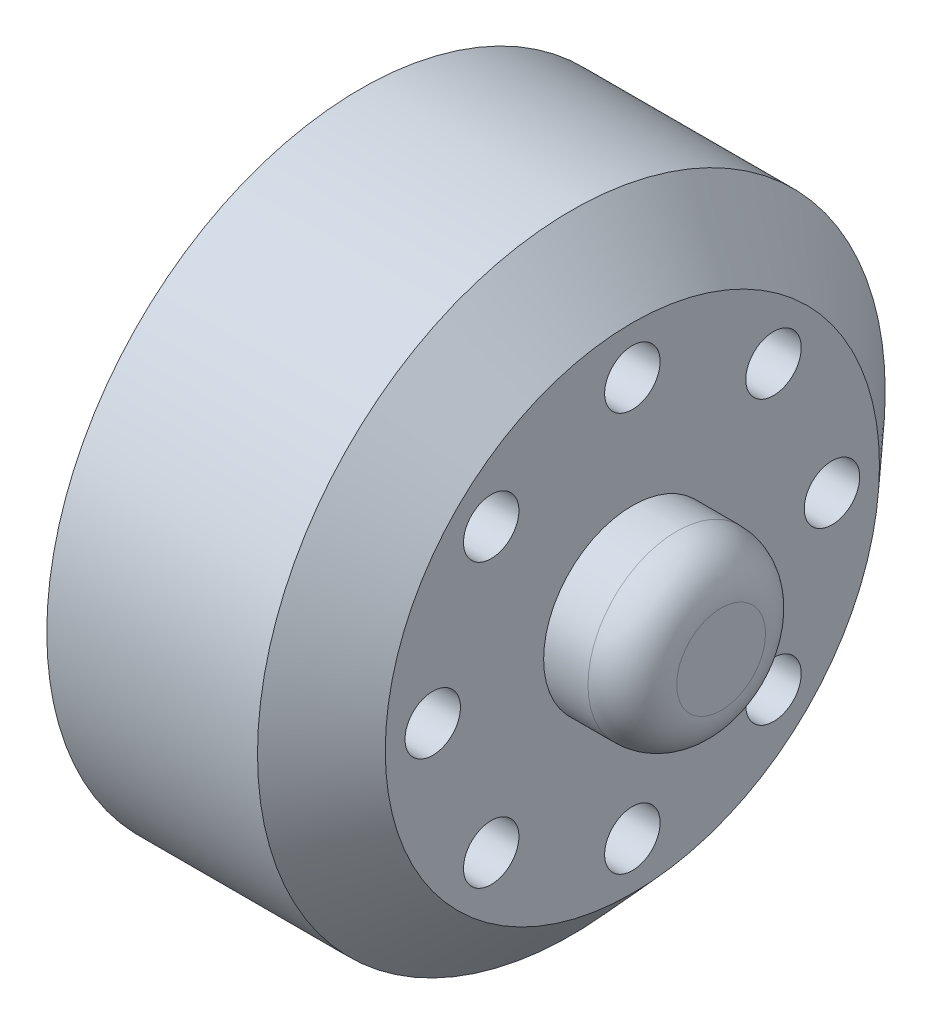
ISO-10303-21;
HEADER;
FILE_DESCRIPTION(('STEP AP214'),'2;1');
FILE_NAME('part.step','',(''),(''),'','','');
FILE_SCHEMA(('AUTOMOTIVE_DESIGN { 1 0 10303 214 1 1 1 1 }'));
ENDSEC;
DATA;
#1=APPLICATION_CONTEXT('core data for automotive mechanical design processes');
#2=APPLICATION_PROTOCOL_DEFINITION('international standard','automotive_design',2000,#1);
#3=PRODUCT_CONTEXT('',#1,'mechanical');
#4=PRODUCT('Part','Part','',(#3));
#5=PRODUCT_RELATED_PRODUCT_CATEGORY('part','',(#4));
#6=PRODUCT_DEFINITION_FORMATION('','',#4);
#7=PRODUCT_DEFINITION_CONTEXT('part definition',#1,'design');
#8=PRODUCT_DEFINITION('design','',#6,#7);
#9=PRODUCT_DEFINITION_SHAPE('','',#8);
#10=(LENGTH_UNIT() NAMED_UNIT(*) SI_UNIT(.MILLI.,.METRE.));
#11=(NAMED_UNIT(*) PLANE_ANGLE_UNIT() SI_UNIT($,.RADIAN.));
#12=(NAMED_UNIT(*) SI_UNIT($,.STERADIAN.) SOLID_ANGLE_UNIT());
#13=UNCERTAINTY_MEASURE_WITH_UNIT(LENGTH_MEASURE(1.E-05),#10,'distance_accuracy_value','');
#14=(GEOMETRIC_REPRESENTATION_CONTEXT(3) GLOBAL_UNCERTAINTY_ASSIGNED_CONTEXT((#13)) GLOBAL_UNIT_ASSIGNED_CONTEXT((#10,
#11,#12)) REPRESENTATION_CONTEXT('',''));
#15=CARTESIAN_POINT('',(0.,0.,0.));
#16=DIRECTION('',(0.,0.,1.));
#17=DIRECTION('',(1.,0.,0.));
#18=AXIS2_PLACEMENT_3D('',#15,#16,#17);
#19=CARTESIAN_POINT('',(-12.3913043478261,0.,0.));
#20=DIRECTION('',(-1.,0.,0.));
#21=DIRECTION('',(0.,0.,1.));
#22=AXIS2_PLACEMENT_3D('',#19,#20,#21);
#23=CYLINDRICAL_SURFACE('',#22,10.5);
#24=CARTESIAN_POINT('',(5.36956521739131,0.,0.));
#25=DIRECTION('',(-1.,0.,0.));
#26=DIRECTION('',(0.,0.,1.));
#27=AXIS2_PLACEMENT_3D('',#24,#25,#26);
#28=CIRCLE('',#27,10.5);
#29=CARTESIAN_POINT('',(5.36956521739131,5.74806476984158,-8.7869079545484));
#30=VERTEX_POINT('',#29);
#31=CARTESIAN_POINT('',(5.36956521739131,2.14878662286819,-10.2777777777778));
#32=VERTEX_POINT('',#31);
#33=EDGE_CURVE('E278',#30,#32,#28,.T.);
#34=ORIENTED_EDGE('',*,*,#33,.F.);
#35=DIRECTION('',(-1.,0.,0.));
#36=VECTOR('',#35,1.);
#37=CARTESIAN_POINT('',(1.99456521739131,5.74806476984158,-8.78690795454841));
#38=LINE('',#37,#36);
#39=CARTESIAN_POINT('',(-1.63043478260869,5.74806476984159,-8.78690795454841));
#40=VERTEX_POINT('',#39);
#41=EDGE_CURVE('E12',#30,#40,#38,.T.);
#42=ORIENTED_EDGE('',*,*,#41,.T.);
#43=CARTESIAN_POINT('',(-1.63043478260869,0.,0.));
#44=DIRECTION('',(-1.,0.,0.));
#45=DIRECTION('',(0.,0.,1.));
#46=AXIS2_PLACEMENT_3D('',#43,#44,#45);
#47=CIRCLE('',#46,10.5);
#48=CARTESIAN_POINT('',(-1.63043478260869,2.14878662286819,-10.2777777777778));
#49=VERTEX_POINT('',#48);
#50=EDGE_CURVE('E183',#40,#49,#47,.T.);
#51=ORIENTED_EDGE('',*,*,#50,.T.);
#52=DIRECTION('',(-1.,0.,0.));
#53=VECTOR('',#52,1.);
#54=CARTESIAN_POINT('',(1.99456521739131,2.14878662286819,-10.2777777777778));
#55=LINE('',#54,#53);
#56=EDGE_CURVE('E260',#49,#32,#55,.F.);
#57=ORIENTED_EDGE('',*,*,#56,.T.);
#58=EDGE_LOOP('',(#34,#42,#51,#57));
#59=FACE_BOUND('',#58,.T.);
#60=ADVANCED_FACE('F35',(#59),#23,.F.);
#61=CARTESIAN_POINT('',(5.36956521739131,-2.14878662286994,-10.2777777777774));
#62=VERTEX_POINT('',#61);
#63=CARTESIAN_POINT('',(5.36956521739131,-5.74806476984194,-8.78690795454817));
#64=VERTEX_POINT('',#63);
#65=EDGE_CURVE('E279',#62,#64,#28,.T.);
#66=ORIENTED_EDGE('',*,*,#65,.F.);
#67=DIRECTION('',(-1.,0.,0.));
#68=VECTOR('',#67,1.);
#69=CARTESIAN_POINT('',(1.99456521739131,-2.14878662286994,-10.2777777777774));
#70=LINE('',#69,#68);
#71=CARTESIAN_POINT('',(-1.63043478260869,-2.14878662286994,-10.2777777777774));
#72=VERTEX_POINT('',#71);
#73=EDGE_CURVE('E263',#62,#72,#70,.T.);
#74=ORIENTED_EDGE('',*,*,#73,.T.);
#75=CARTESIAN_POINT('',(-1.63043478260869,-5.74806476984194,-8.78690795454817));
#76=VERTEX_POINT('',#75);
#77=EDGE_CURVE('E766',#72,#76,#47,.T.);
#78=ORIENTED_EDGE('',*,*,#77,.T.);
#79=DIRECTION('',(-1.,0.,0.));
#80=VECTOR('',#79,1.);
#81=CARTESIAN_POINT('',(1.99456521739131,-5.74806476984194,-8.78690795454817));
#82=LINE('',#81,#80);
#83=EDGE_CURVE('E254',#76,#64,#82,.F.);
#84=ORIENTED_EDGE('',*,*,#83,.T.);
#85=EDGE_LOOP('',(#66,#74,#78,#84));
#86=FACE_BOUND('',#85,.T.);
#87=ADVANCED_FACE('F399',(#86),#23,.F.);
#88=CARTESIAN_POINT('',(5.36956521739131,-8.78690795454984,-5.74806476983939));
#89=VERTEX_POINT('',#88);
#90=CARTESIAN_POINT('',(5.36956521739131,-10.2777777777777,-2.14878662286847));
#91=VERTEX_POINT('',#90);
#92=EDGE_CURVE('E282',#89,#91,#28,.T.);
#93=ORIENTED_EDGE('',*,*,#92,.F.);
#94=DIRECTION('',(-1.,0.,0.));
#95=VECTOR('',#94,1.);
#96=CARTESIAN_POINT('',(1.99456521739131,-8.78690795454984,-5.74806476983939));
#97=LINE('',#96,#95);
#98=CARTESIAN_POINT('',(-1.63043478260869,-8.78690795454984,-5.74806476983939));
#99=VERTEX_POINT('',#98);
#100=EDGE_CURVE('E257',#89,#99,#97,.T.);
#101=ORIENTED_EDGE('',*,*,#100,.T.);
#102=CARTESIAN_POINT('',(-1.63043478260869,-10.2777777777777,-2.14878662286847));
#103=VERTEX_POINT('',#102);
#104=EDGE_CURVE('E765',#99,#103,#47,.T.);
#105=ORIENTED_EDGE('',*,*,#104,.T.);
#106=DIRECTION('',(-1.,0.,0.));
#107=VECTOR('',#106,1.);
#108=CARTESIAN_POINT('',(1.99456521739131,-10.2777777777777,-2.14878662286847));
#109=LINE('',#108,#107);
#110=EDGE_CURVE('E248',#103,#91,#109,.F.);
#111=ORIENTED_EDGE('',*,*,#110,.T.);
#112=EDGE_LOOP('',(#93,#101,#105,#111));
#113=FACE_BOUND('',#112,.T.);
#114=ADVANCED_FACE('F405',(#113),#23,.F.);
#115=CARTESIAN_POINT('',(5.36956521739131,-10.277777777777,2.14878662287197));
#116=VERTEX_POINT('',#115);
#117=CARTESIAN_POINT('',(5.36956521739131,-8.78690795454833,5.7480647698417));
#118=VERTEX_POINT('',#117);
#119=EDGE_CURVE('E286',#116,#118,#28,.T.);
#120=ORIENTED_EDGE('',*,*,#119,.F.);
#121=DIRECTION('',(-1.,0.,0.));
#122=VECTOR('',#121,1.);
#123=CARTESIAN_POINT('',(1.99456521739131,-10.277777777777,2.14878662287196));
#124=LINE('',#123,#122);
#125=CARTESIAN_POINT('',(-1.63043478260869,-10.277777777777,2.14878662287196));
#126=VERTEX_POINT('',#125);
#127=EDGE_CURVE('E251',#116,#126,#124,.T.);
#128=ORIENTED_EDGE('',*,*,#127,.T.);
#129=CARTESIAN_POINT('',(-1.63043478260869,-8.78690795454833,5.7480647698417));
#130=VERTEX_POINT('',#129);
#131=EDGE_CURVE('E761',#126,#130,#47,.T.);
#132=ORIENTED_EDGE('',*,*,#131,.T.);
#133=DIRECTION('',(-1.,0.,0.));
#134=VECTOR('',#133,1.);
#135=CARTESIAN_POINT('',(1.99456521739131,-8.78690795454833,5.74806476984171));
#136=LINE('',#135,#134);
#137=EDGE_CURVE('E243',#130,#118,#136,.F.);
#138=ORIENTED_EDGE('',*,*,#137,.T.);
#139=EDGE_LOOP('',(#120,#128,#132,#138));
#140=FACE_BOUND('',#139,.T.);
#141=ADVANCED_FACE('F426',(#140),#23,.F.);
#142=CARTESIAN_POINT('',(5.36956521739131,-5.74806476983915,8.78690795454999));
#143=VERTEX_POINT('',#142);
#144=CARTESIAN_POINT('',(5.36956521739131,-2.14878662286855,10.2777777777777));
#145=VERTEX_POINT('',#144);
#146=EDGE_CURVE('E181',#143,#145,#28,.T.);
#147=ORIENTED_EDGE('',*,*,#146,.F.);
#148=DIRECTION('',(-1.,0.,0.));
#149=VECTOR('',#148,1.);
#150=CARTESIAN_POINT('',(1.99456521739131,-5.74806476983915,8.78690795454999));
#151=LINE('',#150,#149);
#152=CARTESIAN_POINT('',(-1.63043478260869,-5.74806476983915,8.78690795454999));
#153=VERTEX_POINT('',#152);
#154=EDGE_CURVE('E245',#143,#153,#151,.T.);
#155=ORIENTED_EDGE('',*,*,#154,.T.);
#156=CARTESIAN_POINT('',(-1.63043478260869,-2.14878662286855,10.2777777777777));
#157=VERTEX_POINT('',#156);
#158=EDGE_CURVE('E182',#153,#157,#47,.T.);
#159=ORIENTED_EDGE('',*,*,#158,.T.);
#160=DIRECTION('',(-1.,0.,0.));
#161=VECTOR('',#160,1.);
#162=CARTESIAN_POINT('',(1.99456521739131,-2.14878662286855,10.2777777777777));
#163=LINE('',#162,#161);
#164=EDGE_CURVE('E238',#157,#145,#163,.F.);
#165=ORIENTED_EDGE('',*,*,#164,.T.);
#166=EDGE_LOOP('',(#147,#155,#159,#165));
#167=FACE_BOUND('',#166,.T.);
#168=ADVANCED_FACE('F295',(#167),#23,.F.);
#169=CARTESIAN_POINT('',(5.36956521739131,2.14878662287029,10.2777777777773));
#170=VERTEX_POINT('',#169);
#171=CARTESIAN_POINT('',(5.36956521739131,5.74806476984186,8.78690795454823));
#172=VERTEX_POINT('',#171);
#173=EDGE_CURVE('E188',#170,#172,#28,.T.);
#174=ORIENTED_EDGE('',*,*,#173,.F.);
#175=DIRECTION('',(-1.,0.,0.));
#176=VECTOR('',#175,1.);
#177=CARTESIAN_POINT('',(1.99456521739131,2.1487866228703,10.2777777777773));
#178=LINE('',#177,#176);
#179=CARTESIAN_POINT('',(-1.63043478260869,2.1487866228703,10.2777777777773));
#180=VERTEX_POINT('',#179);
#181=EDGE_CURVE('E240',#170,#180,#178,.T.);
#182=ORIENTED_EDGE('',*,*,#181,.T.);
#183=CARTESIAN_POINT('',(-1.63043478260869,5.74806476984186,8.78690795454822));
#184=VERTEX_POINT('',#183);
#185=EDGE_CURVE('E178',#180,#184,#47,.T.);
#186=ORIENTED_EDGE('',*,*,#185,.T.);
#187=DIRECTION('',(-1.,0.,0.));
#188=VECTOR('',#187,1.);
#189=CARTESIAN_POINT('',(1.99456521739131,5.74806476984186,8.78690795454822));
#190=LINE('',#189,#188);
#191=EDGE_CURVE('E234',#184,#172,#190,.F.);
#192=ORIENTED_EDGE('',*,*,#191,.T.);
#193=EDGE_LOOP('',(#174,#182,#186,#192));
#194=FACE_BOUND('',#193,.T.);
#195=ADVANCED_FACE('F416',(#194),#23,.F.);
#196=CARTESIAN_POINT('',(5.36956521739131,8.78690795454851,5.74806476984141));
#197=VERTEX_POINT('',#196);
#198=CARTESIAN_POINT('',(5.36956521739131,10.2777777777778,2.14878662286819));
#199=VERTEX_POINT('',#198);
#200=EDGE_CURVE('E192',#197,#199,#28,.T.);
#201=ORIENTED_EDGE('',*,*,#200,.F.);
#202=DIRECTION('',(-1.,0.,0.));
#203=VECTOR('',#202,1.);
#204=CARTESIAN_POINT('',(1.99456521739131,8.78690795454851,5.74806476984141));
#205=LINE('',#204,#203);
#206=CARTESIAN_POINT('',(-1.63043478260869,8.78690795454851,5.74806476984142));
#207=VERTEX_POINT('',#206);
#208=EDGE_CURVE('E177',#197,#207,#205,.T.);
#209=ORIENTED_EDGE('',*,*,#208,.T.);
#210=CARTESIAN_POINT('',(-1.63043478260869,10.2777777777778,2.14878662286819));
#211=VERTEX_POINT('',#210);
#212=EDGE_CURVE('E168',#207,#211,#47,.T.);
#213=ORIENTED_EDGE('',*,*,#212,.T.);
#214=DIRECTION('',(-1.,0.,0.));
#215=VECTOR('',#214,1.);
#216=CARTESIAN_POINT('',(1.99456521739131,10.2777777777778,2.14878662286819));
#217=LINE('',#216,#215);
#218=EDGE_CURVE('E147',#211,#199,#217,.F.);
#219=ORIENTED_EDGE('',*,*,#218,.T.);
#220=EDGE_LOOP('',(#201,#209,#213,#219));
#221=FACE_BOUND('',#220,.T.);
#222=ADVANCED_FACE('F176',(#221),#23,.F.);
#223=CARTESIAN_POINT('',(-5.16596868854574,6.36396103067838,6.3639610306787));
#224=DIRECTION('',(1.,0.,0.));
#225=DIRECTION('',(0.,0.,-1.));
#226=AXIS2_PLACEMENT_3D('',#223,#224,#225);
#227=CYLINDRICAL_SURFACE('',#226,1.25000000000048);
#228=CARTESIAN_POINT('',(10.6195652173913,6.36396103067838,6.3639610306787));
#229=DIRECTION('',(1.,0.,0.));
#230=DIRECTION('',(0.,0.,-1.));
#231=AXIS2_PLACEMENT_3D('',#228,#229,#230);
#232=CIRCLE('',#231,1.25000000000048);
#233=CARTESIAN_POINT('',(10.6195652173913,6.36396103067838,5.11396103067823));
#234=VERTEX_POINT('',#233);
#235=EDGE_CURVE('E186',#234,#234,#232,.T.);
#236=ORIENTED_EDGE('',*,*,#235,.T.);
#237=EDGE_LOOP('',(#236));
#238=FACE_BOUND('',#237,.T.);
#239=CARTESIAN_POINT('',(5.61956521739131,6.36396103067838,6.3639610306787));
#240=DIRECTION('',(-1.,0.,0.));
#241=DIRECTION('',(0.,0.,1.));
#242=AXIS2_PLACEMENT_3D('',#239,#240,#241);
#243=CIRCLE('',#242,1.25000000000048);
#244=CARTESIAN_POINT('',(5.61956521739131,6.36396103067838,7.61396103067918));
#245=VERTEX_POINT('',#244);
#246=EDGE_CURVE('E230',#245,#245,#243,.F.);
#247=ORIENTED_EDGE('',*,*,#246,.F.);
#248=EDGE_LOOP('',(#247));
#249=FACE_BOUND('',#248,.T.);
#250=ADVANCED_FACE('F375',(#238,#249),#227,.F.);
#251=CARTESIAN_POINT('',(-5.16596868854574,-7.66835063561292E-13,8.99999999999923));
#252=DIRECTION('',(1.,0.,0.));
#253=DIRECTION('',(0.,0.,-1.));
#254=AXIS2_PLACEMENT_3D('',#251,#252,#253);
#255=CYLINDRICAL_SURFACE('',#254,1.25000000000105);
#256=CARTESIAN_POINT('',(10.6195652173913,-7.66835063561292E-13,8.99999999999923));
#257=DIRECTION('',(1.,0.,0.));
#258=DIRECTION('',(0.,0.,-1.));
#259=AXIS2_PLACEMENT_3D('',#256,#257,#258);
#260=CIRCLE('',#259,1.25000000000105);
#261=CARTESIAN_POINT('',(10.6195652173913,-7.66835063561292E-13,7.74999999999819));
#262=VERTEX_POINT('',#261);
#263=EDGE_CURVE('E368',#262,#262,#260,.T.);
#264=ORIENTED_EDGE('',*,*,#263,.T.);
#265=EDGE_LOOP('',(#264));
#266=FACE_BOUND('',#265,.T.);
#267=CARTESIAN_POINT('',(5.61956521739131,-7.66835063561292E-13,8.99999999999923));
#268=DIRECTION('',(-1.,0.,0.));
#269=DIRECTION('',(0.,0.,1.));
#270=AXIS2_PLACEMENT_3D('',#267,#268,#269);
#271=CIRCLE('',#270,1.25000000000105);
#272=CARTESIAN_POINT('',(5.61956521739131,-7.66835063561292E-13,10.2500000000003));
#273=VERTEX_POINT('',#272);
#274=EDGE_CURVE('E227',#273,#273,#271,.F.);
#275=ORIENTED_EDGE('',*,*,#274,.F.);
#276=EDGE_LOOP('',(#275));
#277=FACE_BOUND('',#276,.T.);
#278=ADVANCED_FACE('F421',(#266,#277),#255,.F.);
#279=CARTESIAN_POINT('',(-5.16596868854574,-6.36396103067947,6.36396103067762));
#280=DIRECTION('',(1.,0.,0.));
#281=DIRECTION('',(0.,0.,-1.));
#282=AXIS2_PLACEMENT_3D('',#279,#280,#281);
#283=CYLINDRICAL_SURFACE('',#282,1.25000000000148);
#284=CARTESIAN_POINT('',(10.6195652173913,-6.36396103067947,6.36396103067762));
#285=DIRECTION('',(1.,0.,0.));
#286=DIRECTION('',(0.,0.,-1.));
#287=AXIS2_PLACEMENT_3D('',#284,#285,#286);
#288=CIRCLE('',#287,1.25000000000148);
#289=CARTESIAN_POINT('',(10.6195652173913,-6.36396103067947,5.11396103067614));
#290=VERTEX_POINT('',#289);
#291=EDGE_CURVE('E366',#290,#290,#288,.T.);
#292=ORIENTED_EDGE('',*,*,#291,.T.);
#293=EDGE_LOOP('',(#292));
#294=FACE_BOUND('',#293,.T.);
#295=CARTESIAN_POINT('',(5.61956521739131,-6.36396103067947,6.36396103067762));
#296=DIRECTION('',(-1.,0.,0.));
#297=DIRECTION('',(0.,0.,1.));
#298=AXIS2_PLACEMENT_3D('',#295,#296,#297);
#299=CIRCLE('',#298,1.25000000000148);
#300=CARTESIAN_POINT('',(5.61956521739131,-6.36396103067947,7.6139610306791));
#301=VERTEX_POINT('',#300);
#302=EDGE_CURVE('E224',#301,#301,#299,.F.);
#303=ORIENTED_EDGE('',*,*,#302,.F.);
#304=EDGE_LOOP('',(#303));
#305=FACE_BOUND('',#304,.T.);
#306=ADVANCED_FACE('F516',(#294,#305),#283,.F.);
#307=CARTESIAN_POINT('',(-5.16596868854574,-9.,-1.53146576288412E-12));
#308=DIRECTION('',(1.,0.,0.));
#309=DIRECTION('',(0.,0.,-1.));
#310=AXIS2_PLACEMENT_3D('',#307,#308,#309);
#311=CYLINDRICAL_SURFACE('',#310,1.25000000000152);
#312=CARTESIAN_POINT('',(10.6195652173913,-9.,-1.53146576288412E-12));
#313=DIRECTION('',(1.,0.,0.));
#314=DIRECTION('',(0.,0.,-1.));
#315=AXIS2_PLACEMENT_3D('',#312,#313,#314);
#316=CIRCLE('',#315,1.25000000000152);
#317=CARTESIAN_POINT('',(10.6195652173913,-9.,-1.25000000000306));
#318=VERTEX_POINT('',#317);
#319=EDGE_CURVE('E363',#318,#318,#316,.T.);
#320=ORIENTED_EDGE('',*,*,#319,.T.);
#321=EDGE_LOOP('',(#320));
#322=FACE_BOUND('',#321,.T.);
#323=CARTESIAN_POINT('',(5.61956521739131,-9.,-1.53146576288412E-12));
#324=DIRECTION('',(-1.,0.,0.));
#325=DIRECTION('',(0.,0.,1.));
#326=AXIS2_PLACEMENT_3D('',#323,#324,#325);
#327=CIRCLE('',#326,1.25000000000152);
#328=CARTESIAN_POINT('',(5.61956521739131,-9.,1.24999999999999));
#329=VERTEX_POINT('',#328);
#330=EDGE_CURVE('E221',#329,#329,#327,.F.);
#331=ORIENTED_EDGE('',*,*,#330,.F.);
#332=EDGE_LOOP('',(#331));
#333=FACE_BOUND('',#332,.T.);
#334=ADVANCED_FACE('F512',(#322,#333),#311,.F.);
#335=CARTESIAN_POINT('',(-5.16596868854574,-6.36396103067839,-6.36396103068023));
#336=DIRECTION('',(1.,0.,0.));
#337=DIRECTION('',(0.,0.,-1.));
#338=AXIS2_PLACEMENT_3D('',#335,#336,#337);
#339=CYLINDRICAL_SURFACE('',#338,1.25000000000114);
#340=CARTESIAN_POINT('',(10.6195652173913,-6.36396103067839,-6.36396103068023));
#341=DIRECTION('',(1.,0.,0.));
#342=DIRECTION('',(0.,0.,-1.));
#343=AXIS2_PLACEMENT_3D('',#340,#341,#342);
#344=CIRCLE('',#343,1.25000000000114);
#345=CARTESIAN_POINT('',(10.6195652173913,-6.36396103067839,-7.61396103068137));
#346=VERTEX_POINT('',#345);
#347=EDGE_CURVE('E360',#346,#346,#344,.T.);
#348=ORIENTED_EDGE('',*,*,#347,.T.);
#349=EDGE_LOOP('',(#348));
#350=FACE_BOUND('',#349,.T.);
#351=CARTESIAN_POINT('',(5.61956521739131,-6.36396103067839,-6.36396103068023));
#352=DIRECTION('',(-1.,0.,0.));
#353=DIRECTION('',(0.,0.,1.));
#354=AXIS2_PLACEMENT_3D('',#351,#352,#353);
#355=CIRCLE('',#354,1.25000000000114);
#356=CARTESIAN_POINT('',(5.61956521739131,-6.36396103067839,-5.1139610306791));
#357=VERTEX_POINT('',#356);
#358=EDGE_CURVE('E218',#357,#357,#355,.F.);
#359=ORIENTED_EDGE('',*,*,#358,.F.);
#360=EDGE_LOOP('',(#359));
#361=FACE_BOUND('',#360,.T.);
#362=ADVANCED_FACE('F508',(#350,#361),#339,.F.);
#363=CARTESIAN_POINT('',(-5.16596868854574,7.65732881442059E-13,-9.00000000000076));
#364=DIRECTION('',(1.,0.,0.));
#365=DIRECTION('',(0.,0.,-1.));
#366=AXIS2_PLACEMENT_3D('',#363,#364,#365);
#367=CYLINDRICAL_SURFACE('',#366,1.25000000000054);
#368=CARTESIAN_POINT('',(10.6195652173913,7.65732881442059E-13,-9.00000000000076));
#369=DIRECTION('',(1.,0.,0.));
#370=DIRECTION('',(0.,0.,-1.));
#371=AXIS2_PLACEMENT_3D('',#368,#369,#370);
#372=CIRCLE('',#371,1.25000000000054);
#373=CARTESIAN_POINT('',(10.6195652173913,7.65732881442059E-13,-10.2500000000013));
#374=VERTEX_POINT('',#373);
#375=EDGE_CURVE('E357',#374,#374,#372,.T.);
#376=ORIENTED_EDGE('',*,*,#375,.T.);
#377=EDGE_LOOP('',(#376));
#378=FACE_BOUND('',#377,.T.);
#379=CARTESIAN_POINT('',(5.61956521739131,7.65732881442059E-13,-9.00000000000076));
#380=DIRECTION('',(-1.,0.,0.));
#381=DIRECTION('',(0.,0.,1.));
#382=AXIS2_PLACEMENT_3D('',#379,#380,#381);
#383=CIRCLE('',#382,1.25000000000054);
#384=CARTESIAN_POINT('',(5.61956521739131,7.65732881442059E-13,-7.75000000000023));
#385=VERTEX_POINT('',#384);
#386=EDGE_CURVE('E215',#385,#385,#383,.F.);
#387=ORIENTED_EDGE('',*,*,#386,.F.);
#388=EDGE_LOOP('',(#387));
#389=FACE_BOUND('',#388,.T.);
#390=ADVANCED_FACE('F504',(#378,#389),#367,.F.);
#391=CARTESIAN_POINT('',(-5.16596868854574,6.36396103067947,-6.36396103067915));
#392=DIRECTION('',(1.,0.,0.));
#393=DIRECTION('',(0.,0.,-1.));
#394=AXIS2_PLACEMENT_3D('',#391,#392,#393);
#395=CYLINDRICAL_SURFACE('',#394,1.25000000000007);
#396=CARTESIAN_POINT('',(10.6195652173913,6.36396103067947,-6.36396103067915));
#397=DIRECTION('',(1.,0.,0.));
#398=DIRECTION('',(0.,0.,-1.));
#399=AXIS2_PLACEMENT_3D('',#396,#397,#398);
#400=CIRCLE('',#399,1.25000000000007);
#401=CARTESIAN_POINT('',(10.6195652173913,6.36396103067947,-7.61396103067922));
#402=VERTEX_POINT('',#401);
#403=EDGE_CURVE('E354',#402,#402,#400,.T.);
#404=ORIENTED_EDGE('',*,*,#403,.T.);
#405=EDGE_LOOP('',(#404));
#406=FACE_BOUND('',#405,.T.);
#407=CARTESIAN_POINT('',(5.61956521739131,6.36396103067947,-6.36396103067915));
#408=DIRECTION('',(-1.,0.,0.));
#409=DIRECTION('',(0.,0.,1.));
#410=AXIS2_PLACEMENT_3D('',#407,#408,#409);
#411=CIRCLE('',#410,1.25000000000007);
#412=CARTESIAN_POINT('',(5.61956521739131,6.36396103067947,-5.11396103067908));
#413=VERTEX_POINT('',#412);
#414=EDGE_CURVE('E212',#413,#413,#411,.F.);
#415=ORIENTED_EDGE('',*,*,#414,.F.);
#416=EDGE_LOOP('',(#415));
#417=FACE_BOUND('',#416,.T.);
#418=ADVANCED_FACE('F500',(#406,#417),#395,.F.);
#419=CARTESIAN_POINT('',(-5.16596868854574,9.,0.));
#420=DIRECTION('',(1.,0.,0.));
#421=DIRECTION('',(0.,0.,-1.));
#422=AXIS2_PLACEMENT_3D('',#419,#420,#421);
#423=CYLINDRICAL_SURFACE('',#422,1.25);
#424=CARTESIAN_POINT('',(10.6195652173913,9.,0.));
#425=DIRECTION('',(1.,0.,0.));
#426=DIRECTION('',(0.,0.,-1.));
#427=AXIS2_PLACEMENT_3D('',#424,#425,#426);
#428=CIRCLE('',#427,1.25);
#429=CARTESIAN_POINT('',(10.6195652173913,9.,-1.25));
#430=VERTEX_POINT('',#429);
#431=EDGE_CURVE('E351',#430,#430,#428,.T.);
#432=ORIENTED_EDGE('',*,*,#431,.T.);
#433=EDGE_LOOP('',(#432));
#434=FACE_BOUND('',#433,.T.);
#435=CARTESIAN_POINT('',(5.61956521739131,9.,0.));
#436=DIRECTION('',(-1.,0.,0.));
#437=DIRECTION('',(0.,0.,1.));
#438=AXIS2_PLACEMENT_3D('',#435,#436,#437);
#439=CIRCLE('',#438,1.25);
#440=CARTESIAN_POINT('',(5.61956521739131,9.,1.25));
#441=VERTEX_POINT('',#440);
#442=EDGE_CURVE('E209',#441,#441,#439,.F.);
#443=ORIENTED_EDGE('',*,*,#442,.F.);
#444=EDGE_LOOP('',(#443));
#445=FACE_BOUND('',#444,.T.);
#446=ADVANCED_FACE('F497',(#434,#445),#423,.F.);
#447=CARTESIAN_POINT('',(-1.63043478260869,0.,-14.15));
#448=DIRECTION('',(1.,0.,0.));
#449=DIRECTION('',(0.,0.,-1.));
#450=AXIS2_PLACEMENT_3D('',#447,#448,#449);
#451=PLANE('',#450);
#452=ORIENTED_EDGE('',*,*,#50,.F.);
#453=CARTESIAN_POINT('',(-1.63043478260869,6.36396103067838,-6.3639610306787));
#454=DIRECTION('',(-1.,0.,0.));
#455=DIRECTION('',(0.,0.,1.));
#456=AXIS2_PLACEMENT_3D('',#453,#454,#455);
#457=CIRCLE('',#456,2.50000000000048);
#458=CARTESIAN_POINT('',(-1.63043478260869,8.78690795454812,-5.74806476984203));
#459=VERTEX_POINT('',#458);
#460=EDGE_CURVE('E332',#459,#40,#457,.T.);
#461=ORIENTED_EDGE('',*,*,#460,.F.);
#462=CARTESIAN_POINT('',(-1.63043478260869,10.2777777777778,-2.14878662286819));
#463=VERTEX_POINT('',#462);
#464=EDGE_CURVE('E171',#463,#459,#47,.T.);
#465=ORIENTED_EDGE('',*,*,#464,.F.);
#466=CARTESIAN_POINT('',(-1.63043478260869,9.,0.));
#467=DIRECTION('',(-1.,0.,0.));
#468=DIRECTION('',(0.,0.,1.));
#469=AXIS2_PLACEMENT_3D('',#466,#467,#468);
#470=CIRCLE('',#469,2.5);
#471=EDGE_CURVE('E150',#211,#463,#470,.T.);
#472=ORIENTED_EDGE('',*,*,#471,.F.);
#473=ORIENTED_EDGE('',*,*,#212,.F.);
#474=CARTESIAN_POINT('',(-1.63043478260869,6.36396103067947,6.36396103067915));
#475=DIRECTION('',(-1.,0.,0.));
#476=DIRECTION('',(0.,0.,1.));
#477=AXIS2_PLACEMENT_3D('',#474,#475,#476);
#478=CIRCLE('',#477,2.50000000000007);
#479=EDGE_CURVE('E307',#184,#207,#478,.T.);
#480=ORIENTED_EDGE('',*,*,#479,.F.);
#481=ORIENTED_EDGE('',*,*,#185,.F.);
#482=CARTESIAN_POINT('',(-1.63043478260869,7.65732881442059E-13,9.00000000000076));
#483=DIRECTION('',(-1.,0.,0.));
#484=DIRECTION('',(0.,0.,1.));
#485=AXIS2_PLACEMENT_3D('',#482,#483,#484);
#486=CIRCLE('',#485,2.50000000000054);
#487=EDGE_CURVE('E300',#157,#180,#486,.T.);
#488=ORIENTED_EDGE('',*,*,#487,.F.);
#489=ORIENTED_EDGE('',*,*,#158,.F.);
#490=CARTESIAN_POINT('',(-1.63043478260869,-6.36396103067839,6.36396103068023));
#491=DIRECTION('',(-1.,0.,0.));
#492=DIRECTION('',(0.,0.,1.));
#493=AXIS2_PLACEMENT_3D('',#490,#491,#492);
#494=CIRCLE('',#493,2.50000000000114);
#495=EDGE_CURVE('E310',#130,#153,#494,.T.);
#496=ORIENTED_EDGE('',*,*,#495,.F.);
#497=ORIENTED_EDGE('',*,*,#131,.F.);
#498=CARTESIAN_POINT('',(-1.63043478260869,-9.,1.53146576288412E-12));
#499=DIRECTION('',(-1.,0.,0.));
#500=DIRECTION('',(0.,0.,1.));
#501=AXIS2_PLACEMENT_3D('',#498,#499,#500);
#502=CIRCLE('',#501,2.50000000000153);
#503=EDGE_CURVE('E317',#103,#126,#502,.T.);
#504=ORIENTED_EDGE('',*,*,#503,.F.);
#505=ORIENTED_EDGE('',*,*,#104,.F.);
#506=CARTESIAN_POINT('',(-1.63043478260869,-6.36396103067947,-6.36396103067762));
#507=DIRECTION('',(-1.,0.,0.));
#508=DIRECTION('',(0.,0.,1.));
#509=AXIS2_PLACEMENT_3D('',#506,#507,#508);
#510=CIRCLE('',#509,2.50000000000148);
#511=EDGE_CURVE('E322',#76,#99,#510,.T.);
#512=ORIENTED_EDGE('',*,*,#511,.F.);
#513=ORIENTED_EDGE('',*,*,#77,.F.);
#514=CARTESIAN_POINT('',(-1.63043478260869,-7.66835063561292E-13,-8.99999999999923));
#515=DIRECTION('',(-1.,0.,0.));
#516=DIRECTION('',(0.,0.,1.));
#517=AXIS2_PLACEMENT_3D('',#514,#515,#516);
#518=CIRCLE('',#517,2.50000000000105);
#519=EDGE_CURVE('E327',#49,#72,#518,.T.);
#520=ORIENTED_EDGE('',*,*,#519,.F.);
#521=EDGE_LOOP('',(#452,#461,#465,#472,#473,#480,#481,#488,#489,#496,#497,#504,#505,#512,#513,#520));
#522=FACE_BOUND('',#521,.T.);
#523=CARTESIAN_POINT('',(-1.63043478260869,0.,0.));
#524=DIRECTION('',(-1.,0.,0.));
#525=DIRECTION('',(0.,0.,1.));
#526=AXIS2_PLACEMENT_3D('',#523,#524,#525);
#527=CIRCLE('',#526,14.15);
#528=CARTESIAN_POINT('',(-1.63043478260869,0.,14.15));
#529=VERTEX_POINT('',#528);
#530=EDGE_CURVE('E201',#529,#529,#527,.T.);
#531=ORIENTED_EDGE('',*,*,#530,.T.);
#532=EDGE_LOOP('',(#531));
#533=FACE_BOUND('',#532,.T.);
#534=ADVANCED_FACE('F165',(#522,#533),#451,.F.);
#535=CARTESIAN_POINT('',(-12.3913043478261,0.,0.));
#536=DIRECTION('',(-1.,0.,0.));
#537=DIRECTION('',(0.,0.,1.));
#538=AXIS2_PLACEMENT_3D('',#535,#536,#537);
#539=CYLINDRICAL_SURFACE('',#538,14.15);
#540=ORIENTED_EDGE('',*,*,#530,.F.);
#541=EDGE_LOOP('',(#540));
#542=FACE_BOUND('',#541,.T.);
#543=CARTESIAN_POINT('',(7.8695652173913,0.,0.));
#544=DIRECTION('',(-1.,0.,0.));
#545=DIRECTION('',(0.,0.,1.));
#546=AXIS2_PLACEMENT_3D('',#543,#544,#545);
#547=CIRCLE('',#546,14.15);
#548=CARTESIAN_POINT('',(7.8695652173913,0.,14.15));
#549=VERTEX_POINT('',#548);
#550=EDGE_CURVE('E198',#549,#549,#547,.T.);
#551=ORIENTED_EDGE('',*,*,#550,.T.);
#552=EDGE_LOOP('',(#551));
#553=FACE_BOUND('',#552,.T.);
#554=ADVANCED_FACE('F559',(#542,#553),#539,.T.);
#555=CARTESIAN_POINT('',(10.6195652173913,0.,0.));
#556=DIRECTION('',(-1.,0.,0.));
#557=DIRECTION('',(0.,0.,1.));
#558=AXIS2_PLACEMENT_3D('',#555,#556,#557);
#559=CONICAL_SURFACE('',#558,11.1404761178154,0.830427658098904);
#560=ORIENTED_EDGE('',*,*,#550,.F.);
#561=EDGE_LOOP('',(#560));
#562=FACE_BOUND('',#561,.T.);
#563=CARTESIAN_POINT('',(10.6195652173913,0.,0.));
#564=DIRECTION('',(-1.,0.,0.));
#565=DIRECTION('',(0.,0.,1.));
#566=AXIS2_PLACEMENT_3D('',#563,#564,#565);
#567=CIRCLE('',#566,11.1404761178154);
#568=CARTESIAN_POINT('',(10.6195652173913,0.,11.1404761178154));
#569=VERTEX_POINT('',#568);
#570=EDGE_CURVE('E195',#569,#569,#567,.T.);
#571=ORIENTED_EDGE('',*,*,#570,.T.);
#572=EDGE_LOOP('',(#571));
#573=FACE_BOUND('',#572,.T.);
#574=ADVANCED_FACE('F382',(#562,#573),#559,.T.);
#575=CARTESIAN_POINT('',(10.6195652173913,0.,-11.1404761178154));
#576=DIRECTION('',(-1.,0.,0.));
#577=DIRECTION('',(0.,0.,1.));
#578=AXIS2_PLACEMENT_3D('',#575,#576,#577);
#579=PLANE('',#578);
#580=ORIENTED_EDGE('',*,*,#431,.F.);
#581=EDGE_LOOP('',(#580));
#582=FACE_BOUND('',#581,.T.);
#583=ORIENTED_EDGE('',*,*,#403,.F.);
#584=EDGE_LOOP('',(#583));
#585=FACE_BOUND('',#584,.T.);
#586=ORIENTED_EDGE('',*,*,#375,.F.);
#587=EDGE_LOOP('',(#586));
#588=FACE_BOUND('',#587,.T.);
#589=ORIENTED_EDGE('',*,*,#347,.F.);
#590=EDGE_LOOP('',(#589));
#591=FACE_BOUND('',#590,.T.);
#592=ORIENTED_EDGE('',*,*,#319,.F.);
#593=EDGE_LOOP('',(#592));
#594=FACE_BOUND('',#593,.T.);
#595=ORIENTED_EDGE('',*,*,#291,.F.);
#596=EDGE_LOOP('',(#595));
#597=FACE_BOUND('',#596,.T.);
#598=ORIENTED_EDGE('',*,*,#263,.F.);
#599=EDGE_LOOP('',(#598));
#600=FACE_BOUND('',#599,.T.);
#601=ORIENTED_EDGE('',*,*,#235,.F.);
#602=EDGE_LOOP('',(#601));
#603=FACE_BOUND('',#602,.T.);
#604=ORIENTED_EDGE('',*,*,#570,.F.);
#605=EDGE_LOOP('',(#604));
#606=FACE_BOUND('',#605,.T.);
#607=CARTESIAN_POINT('',(10.6195652173913,0.,0.));
#608=DIRECTION('',(-1.,0.,0.));
#609=DIRECTION('',(0.,0.,1.));
#610=AXIS2_PLACEMENT_3D('',#607,#608,#609);
#611=CIRCLE('',#610,4.);
#612=CARTESIAN_POINT('',(10.6195652173913,0.,4.));
#613=VERTEX_POINT('',#612);
#614=EDGE_CURVE('E191',#613,#613,#611,.T.);
#615=ORIENTED_EDGE('',*,*,#614,.T.);
#616=EDGE_LOOP('',(#615));
#617=FACE_BOUND('',#616,.T.);
#618=ADVANCED_FACE('F378',(#582,#585,#588,#591,#594,#597,#600,#603,#606,#617),#579,.F.);
#619=CARTESIAN_POINT('',(-12.3913043478261,0.,0.));
#620=DIRECTION('',(-1.,0.,0.));
#621=DIRECTION('',(0.,0.,1.));
#622=AXIS2_PLACEMENT_3D('',#619,#620,#621);
#623=CYLINDRICAL_SURFACE('',#622,4.);
#624=CARTESIAN_POINT('',(12.6195652173913,0.,0.));
#625=DIRECTION('',(-1.,0.,0.));
#626=DIRECTION('',(0.,0.,1.));
#627=AXIS2_PLACEMENT_3D('',#624,#625,#626);
#628=CIRCLE('',#627,4.);
#629=CARTESIAN_POINT('',(12.6195652173913,0.,4.));
#630=VERTEX_POINT('',#629);
#631=EDGE_CURVE('E204',#630,#630,#628,.T.);
#632=ORIENTED_EDGE('',*,*,#631,.T.);
#633=EDGE_LOOP('',(#632));
#634=FACE_BOUND('',#633,.T.);
#635=ORIENTED_EDGE('',*,*,#614,.F.);
#636=EDGE_LOOP('',(#635));
#637=FACE_BOUND('',#636,.T.);
#638=ADVANCED_FACE('F381',(#634,#637),#623,.T.);
#639=CARTESIAN_POINT('',(14.6195652173913,0.,-4.));
#640=DIRECTION('',(-1.,0.,0.));
#641=DIRECTION('',(0.,0.,1.));
#642=AXIS2_PLACEMENT_3D('',#639,#640,#641);
#643=PLANE('',#642);
#644=CARTESIAN_POINT('',(14.6195652173913,0.,0.));
#645=DIRECTION('',(-1.,0.,0.));
#646=DIRECTION('',(0.,0.,1.));
#647=AXIS2_PLACEMENT_3D('',#644,#645,#646);
#648=CIRCLE('',#647,2.);
#649=CARTESIAN_POINT('',(14.6195652173913,0.,2.));
#650=VERTEX_POINT('',#649);
#651=EDGE_CURVE('E159',#650,#650,#648,.F.);
#652=ORIENTED_EDGE('',*,*,#651,.T.);
#653=EDGE_LOOP('',(#652));
#654=FACE_BOUND('',#653,.T.);
#655=ADVANCED_FACE('F390',(#654),#643,.F.);
#656=CARTESIAN_POINT('',(5.36956521739131,0.,-10.5));
#657=DIRECTION('',(1.,0.,0.));
#658=DIRECTION('',(0.,0.,-1.));
#659=AXIS2_PLACEMENT_3D('',#656,#657,#658);
#660=PLANE('',#659);
#661=CARTESIAN_POINT('',(5.36956521739131,10.2777777777778,-2.14878662286819));
#662=VERTEX_POINT('',#661);
#663=CARTESIAN_POINT('',(5.36956521739131,8.78690795454812,-5.74806476984203));
#664=VERTEX_POINT('',#663);
#665=EDGE_CURVE('E270',#662,#664,#28,.T.);
#666=ORIENTED_EDGE('',*,*,#665,.T.);
#667=CARTESIAN_POINT('',(5.36956521739131,6.36396103067838,-6.3639610306787));
#668=DIRECTION('',(1.,0.,0.));
#669=DIRECTION('',(0.,0.,-1.));
#670=AXIS2_PLACEMENT_3D('',#667,#668,#669);
#671=CIRCLE('',#670,2.50000000000048);
#672=EDGE_CURVE('E276',#664,#30,#671,.T.);
#673=ORIENTED_EDGE('',*,*,#672,.T.);
#674=ORIENTED_EDGE('',*,*,#33,.T.);
#675=CARTESIAN_POINT('',(5.36956521739131,-7.66835063561292E-13,-8.99999999999923));
#676=DIRECTION('',(1.,0.,0.));
#677=DIRECTION('',(0.,0.,-1.));
#678=AXIS2_PLACEMENT_3D('',#675,#676,#677);
#679=CIRCLE('',#678,2.50000000000105);
#680=EDGE_CURVE('E348',#32,#62,#679,.T.);
#681=ORIENTED_EDGE('',*,*,#680,.T.);
#682=ORIENTED_EDGE('',*,*,#65,.T.);
#683=CARTESIAN_POINT('',(5.36956521739131,-6.36396103067947,-6.36396103067762));
#684=DIRECTION('',(1.,0.,0.));
#685=DIRECTION('',(0.,0.,-1.));
#686=AXIS2_PLACEMENT_3D('',#683,#684,#685);
#687=CIRCLE('',#686,2.50000000000148);
#688=EDGE_CURVE('E346',#64,#89,#687,.T.);
#689=ORIENTED_EDGE('',*,*,#688,.T.);
#690=ORIENTED_EDGE('',*,*,#92,.T.);
#691=CARTESIAN_POINT('',(5.36956521739131,-9.,1.53146576288412E-12));
#692=DIRECTION('',(1.,0.,0.));
#693=DIRECTION('',(0.,0.,-1.));
#694=AXIS2_PLACEMENT_3D('',#691,#692,#693);
#695=CIRCLE('',#694,2.50000000000153);
#696=EDGE_CURVE('E344',#91,#116,#695,.T.);
#697=ORIENTED_EDGE('',*,*,#696,.T.);
#698=ORIENTED_EDGE('',*,*,#119,.T.);
#699=CARTESIAN_POINT('',(5.36956521739131,-6.36396103067839,6.36396103068023));
#700=DIRECTION('',(1.,0.,0.));
#701=DIRECTION('',(0.,0.,-1.));
#702=AXIS2_PLACEMENT_3D('',#699,#700,#701);
#703=CIRCLE('',#702,2.50000000000114);
#704=EDGE_CURVE('E58',#118,#143,#703,.T.);
#705=ORIENTED_EDGE('',*,*,#704,.T.);
#706=ORIENTED_EDGE('',*,*,#146,.T.);
#707=CARTESIAN_POINT('',(5.36956521739131,7.65732881442059E-13,9.00000000000076));
#708=DIRECTION('',(1.,0.,0.));
#709=DIRECTION('',(0.,0.,-1.));
#710=AXIS2_PLACEMENT_3D('',#707,#708,#709);
#711=CIRCLE('',#710,2.50000000000054);
#712=EDGE_CURVE('E50',#145,#170,#711,.T.);
#713=ORIENTED_EDGE('',*,*,#712,.T.);
#714=ORIENTED_EDGE('',*,*,#173,.T.);
#715=CARTESIAN_POINT('',(5.36956521739131,6.36396103067947,6.36396103067915));
#716=DIRECTION('',(1.,0.,0.));
#717=DIRECTION('',(0.,0.,-1.));
#718=AXIS2_PLACEMENT_3D('',#715,#716,#717);
#719=CIRCLE('',#718,2.50000000000007);
#720=EDGE_CURVE('E339',#172,#197,#719,.T.);
#721=ORIENTED_EDGE('',*,*,#720,.T.);
#722=ORIENTED_EDGE('',*,*,#200,.T.);
#723=CARTESIAN_POINT('',(5.36956521739131,9.,0.));
#724=DIRECTION('',(1.,0.,0.));
#725=DIRECTION('',(0.,0.,-1.));
#726=AXIS2_PLACEMENT_3D('',#723,#724,#725);
#727=CIRCLE('',#726,2.5);
#728=EDGE_CURVE('E153',#199,#662,#727,.T.);
#729=ORIENTED_EDGE('',*,*,#728,.T.);
#730=EDGE_LOOP('',(#666,#673,#674,#681,#682,#689,#690,#697,#698,#705,#706,#713,#714,#721,#722,#729));
#731=FACE_BOUND('',#730,.T.);
#732=ADVANCED_FACE('F274',(#731),#660,.F.);
#733=ORIENTED_EDGE('',*,*,#464,.T.);
#734=DIRECTION('',(-1.,0.,0.));
#735=VECTOR('',#734,1.);
#736=CARTESIAN_POINT('',(1.99456521739131,8.78690795454812,-5.74806476984203));
#737=LINE('',#736,#735);
#738=EDGE_CURVE('E43',#459,#664,#737,.F.);
#739=ORIENTED_EDGE('',*,*,#738,.T.);
#740=ORIENTED_EDGE('',*,*,#665,.F.);
#741=DIRECTION('',(-1.,0.,0.));
#742=VECTOR('',#741,1.);
#743=CARTESIAN_POINT('',(1.99456521739131,10.2777777777778,-2.14878662286819));
#744=LINE('',#743,#742);
#745=EDGE_CURVE('E158',#662,#463,#744,.T.);
#746=ORIENTED_EDGE('',*,*,#745,.T.);
#747=EDGE_LOOP('',(#733,#739,#740,#746));
#748=FACE_BOUND('',#747,.T.);
#749=ADVANCED_FACE('F269',(#748),#23,.F.);
#750=CARTESIAN_POINT('',(12.6195652173913,0.,0.));
#751=DIRECTION('',(-1.,0.,0.));
#752=DIRECTION('',(0.,0.,1.));
#753=AXIS2_PLACEMENT_3D('',#750,#751,#752);
#754=DEGENERATE_TOROIDAL_SURFACE('',#753,2.,2.,.T.);
#755=ORIENTED_EDGE('',*,*,#651,.F.);
#756=EDGE_LOOP('',(#755));
#757=FACE_BOUND('',#756,.T.);
#758=ORIENTED_EDGE('',*,*,#631,.F.);
#759=EDGE_LOOP('',(#758));
#760=FACE_BOUND('',#759,.T.);
#761=ADVANCED_FACE('F37',(#757,#760),#754,.T.);
#762=CARTESIAN_POINT('',(17.6906330292611,9.,0.));
#763=DIRECTION('',(-1.,0.,0.));
#764=DIRECTION('',(0.,0.,1.));
#765=AXIS2_PLACEMENT_3D('',#762,#763,#764);
#766=CYLINDRICAL_SURFACE('',#765,2.5);
#767=CARTESIAN_POINT('',(5.61956521739131,9.,0.));
#768=DIRECTION('',(-1.,0.,0.));
#769=DIRECTION('',(0.,0.,1.));
#770=AXIS2_PLACEMENT_3D('',#767,#768,#769);
#771=CIRCLE('',#770,2.5);
#772=CARTESIAN_POINT('',(5.61956521739131,9.,2.5));
#773=VERTEX_POINT('',#772);
#774=EDGE_CURVE('E172',#773,#773,#771,.F.);
#775=ORIENTED_EDGE('',*,*,#774,.T.);
#776=EDGE_LOOP('',(#775));
#777=FACE_BOUND('',#776,.T.);
#778=ORIENTED_EDGE('',*,*,#728,.F.);
#779=ORIENTED_EDGE('',*,*,#218,.F.);
#780=ORIENTED_EDGE('',*,*,#471,.T.);
#781=ORIENTED_EDGE('',*,*,#745,.F.);
#782=EDGE_LOOP('',(#778,#779,#780,#781));
#783=FACE_BOUND('',#782,.T.);
#784=ADVANCED_FACE('F149',(#777,#783),#766,.F.);
#785=CARTESIAN_POINT('',(5.61956521739131,0.,-11.1404761178154));
#786=DIRECTION('',(-1.,0.,0.));
#787=DIRECTION('',(0.,0.,1.));
#788=AXIS2_PLACEMENT_3D('',#785,#786,#787);
#789=PLANE('',#788);
#790=ORIENTED_EDGE('',*,*,#774,.F.);
#791=EDGE_LOOP('',(#790));
#792=FACE_BOUND('',#791,.T.);
#793=ORIENTED_EDGE('',*,*,#442,.T.);
#794=EDGE_LOOP('',(#793));
#795=FACE_BOUND('',#794,.T.);
#796=ADVANCED_FACE('F489',(#792,#795),#789,.T.);
#797=CARTESIAN_POINT('',(17.6906330292611,6.36396103067838,-6.3639610306787));
#798=DIRECTION('',(-1.,0.,0.));
#799=DIRECTION('',(0.,0.,1.));
#800=AXIS2_PLACEMENT_3D('',#797,#798,#799);
#801=CYLINDRICAL_SURFACE('',#800,2.50000000000048);
#802=CARTESIAN_POINT('',(5.61956521739131,6.36396103067838,-6.3639610306787));
#803=DIRECTION('',(-1.,0.,0.));
#804=DIRECTION('',(0.,0.,1.));
#805=AXIS2_PLACEMENT_3D('',#802,#803,#804);
#806=CIRCLE('',#805,2.50000000000048);
#807=CARTESIAN_POINT('',(5.61956521739131,6.36396103067838,-3.86396103067823));
#808=VERTEX_POINT('',#807);
#809=EDGE_CURVE('E329',#808,#808,#806,.F.);
#810=ORIENTED_EDGE('',*,*,#809,.T.);
#811=EDGE_LOOP('',(#810));
#812=FACE_BOUND('',#811,.T.);
#813=ORIENTED_EDGE('',*,*,#672,.F.);
#814=ORIENTED_EDGE('',*,*,#738,.F.);
#815=ORIENTED_EDGE('',*,*,#460,.T.);
#816=ORIENTED_EDGE('',*,*,#41,.F.);
#817=EDGE_LOOP('',(#813,#814,#815,#816));
#818=FACE_BOUND('',#817,.T.);
#819=ADVANCED_FACE('F485',(#812,#818),#801,.F.);
#820=CARTESIAN_POINT('',(5.61956521739131,0.,-11.1404761178154));
#821=DIRECTION('',(-1.,0.,0.));
#822=DIRECTION('',(0.,0.,1.));
#823=AXIS2_PLACEMENT_3D('',#820,#821,#822);
#824=PLANE('',#823);
#825=ORIENTED_EDGE('',*,*,#809,.F.);
#826=EDGE_LOOP('',(#825));
#827=FACE_BOUND('',#826,.T.);
#828=ORIENTED_EDGE('',*,*,#414,.T.);
#829=EDGE_LOOP('',(#828));
#830=FACE_BOUND('',#829,.T.);
#831=ADVANCED_FACE('F481',(#827,#830),#824,.T.);
#832=CARTESIAN_POINT('',(17.6906330292611,-7.66835063561292E-13,-8.99999999999923));
#833=DIRECTION('',(-1.,0.,0.));
#834=DIRECTION('',(0.,0.,1.));
#835=AXIS2_PLACEMENT_3D('',#832,#833,#834);
#836=CYLINDRICAL_SURFACE('',#835,2.50000000000105);
#837=CARTESIAN_POINT('',(5.61956521739131,-7.66835063561292E-13,-8.99999999999923));
#838=DIRECTION('',(-1.,0.,0.));
#839=DIRECTION('',(0.,0.,1.));
#840=AXIS2_PLACEMENT_3D('',#837,#838,#839);
#841=CIRCLE('',#840,2.50000000000105);
#842=CARTESIAN_POINT('',(5.61956521739131,-7.66835063561292E-13,-6.49999999999819));
#843=VERTEX_POINT('',#842);
#844=EDGE_CURVE('E324',#843,#843,#841,.F.);
#845=ORIENTED_EDGE('',*,*,#844,.T.);
#846=EDGE_LOOP('',(#845));
#847=FACE_BOUND('',#846,.T.);
#848=ORIENTED_EDGE('',*,*,#680,.F.);
#849=ORIENTED_EDGE('',*,*,#56,.F.);
#850=ORIENTED_EDGE('',*,*,#519,.T.);
#851=ORIENTED_EDGE('',*,*,#73,.F.);
#852=EDGE_LOOP('',(#848,#849,#850,#851));
#853=FACE_BOUND('',#852,.T.);
#854=ADVANCED_FACE('F477',(#847,#853),#836,.F.);
#855=CARTESIAN_POINT('',(5.61956521739131,0.,-11.1404761178154));
#856=DIRECTION('',(-1.,0.,0.));
#857=DIRECTION('',(0.,0.,1.));
#858=AXIS2_PLACEMENT_3D('',#855,#856,#857);
#859=PLANE('',#858);
#860=ORIENTED_EDGE('',*,*,#844,.F.);
#861=EDGE_LOOP('',(#860));
#862=FACE_BOUND('',#861,.T.);
#863=ORIENTED_EDGE('',*,*,#386,.T.);
#864=EDGE_LOOP('',(#863));
#865=FACE_BOUND('',#864,.T.);
#866=ADVANCED_FACE('F473',(#862,#865),#859,.T.);
#867=CARTESIAN_POINT('',(17.6906330292611,-6.36396103067947,-6.36396103067762));
#868=DIRECTION('',(-1.,0.,0.));
#869=DIRECTION('',(0.,0.,1.));
#870=AXIS2_PLACEMENT_3D('',#867,#868,#869);
#871=CYLINDRICAL_SURFACE('',#870,2.50000000000148);
#872=CARTESIAN_POINT('',(5.61956521739131,-6.36396103067947,-6.36396103067762));
#873=DIRECTION('',(-1.,0.,0.));
#874=DIRECTION('',(0.,0.,1.));
#875=AXIS2_PLACEMENT_3D('',#872,#873,#874);
#876=CIRCLE('',#875,2.50000000000148);
#877=CARTESIAN_POINT('',(5.61956521739131,-6.36396103067947,-3.86396103067614));
#878=VERTEX_POINT('',#877);
#879=EDGE_CURVE('E319',#878,#878,#876,.F.);
#880=ORIENTED_EDGE('',*,*,#879,.T.);
#881=EDGE_LOOP('',(#880));
#882=FACE_BOUND('',#881,.T.);
#883=ORIENTED_EDGE('',*,*,#688,.F.);
#884=ORIENTED_EDGE('',*,*,#83,.F.);
#885=ORIENTED_EDGE('',*,*,#511,.T.);
#886=ORIENTED_EDGE('',*,*,#100,.F.);
#887=EDGE_LOOP('',(#883,#884,#885,#886));
#888=FACE_BOUND('',#887,.T.);
#889=ADVANCED_FACE('F469',(#882,#888),#871,.F.);
#890=CARTESIAN_POINT('',(5.61956521739131,0.,-11.1404761178154));
#891=DIRECTION('',(-1.,0.,0.));
#892=DIRECTION('',(0.,0.,1.));
#893=AXIS2_PLACEMENT_3D('',#890,#891,#892);
#894=PLANE('',#893);
#895=ORIENTED_EDGE('',*,*,#879,.F.);
#896=EDGE_LOOP('',(#895));
#897=FACE_BOUND('',#896,.T.);
#898=ORIENTED_EDGE('',*,*,#358,.T.);
#899=EDGE_LOOP('',(#898));
#900=FACE_BOUND('',#899,.T.);
#901=ADVANCED_FACE('F465',(#897,#900),#894,.T.);
#902=CARTESIAN_POINT('',(17.6906330292611,-9.,1.53146576288412E-12));
#903=DIRECTION('',(-1.,0.,0.));
#904=DIRECTION('',(0.,0.,1.));
#905=AXIS2_PLACEMENT_3D('',#902,#903,#904);
#906=CYLINDRICAL_SURFACE('',#905,2.50000000000153);
#907=CARTESIAN_POINT('',(5.61956521739131,-9.,1.53146576288412E-12));
#908=DIRECTION('',(-1.,0.,0.));
#909=DIRECTION('',(0.,0.,1.));
#910=AXIS2_PLACEMENT_3D('',#907,#908,#909);
#911=CIRCLE('',#910,2.50000000000153);
#912=CARTESIAN_POINT('',(5.61956521739131,-9.,2.50000000000306));
#913=VERTEX_POINT('',#912);
#914=EDGE_CURVE('E315',#913,#913,#911,.F.);
#915=ORIENTED_EDGE('',*,*,#914,.T.);
#916=EDGE_LOOP('',(#915));
#917=FACE_BOUND('',#916,.T.);
#918=ORIENTED_EDGE('',*,*,#696,.F.);
#919=ORIENTED_EDGE('',*,*,#110,.F.);
#920=ORIENTED_EDGE('',*,*,#503,.T.);
#921=ORIENTED_EDGE('',*,*,#127,.F.);
#922=EDGE_LOOP('',(#918,#919,#920,#921));
#923=FACE_BOUND('',#922,.T.);
#924=ADVANCED_FACE('F461',(#917,#923),#906,.F.);
#925=CARTESIAN_POINT('',(5.61956521739131,0.,-11.1404761178154));
#926=DIRECTION('',(-1.,0.,0.));
#927=DIRECTION('',(0.,0.,1.));
#928=AXIS2_PLACEMENT_3D('',#925,#926,#927);
#929=PLANE('',#928);
#930=ORIENTED_EDGE('',*,*,#914,.F.);
#931=EDGE_LOOP('',(#930));
#932=FACE_BOUND('',#931,.T.);
#933=ORIENTED_EDGE('',*,*,#330,.T.);
#934=EDGE_LOOP('',(#933));
#935=FACE_BOUND('',#934,.T.);
#936=ADVANCED_FACE('F457',(#932,#935),#929,.T.);
#937=CARTESIAN_POINT('',(17.6906330292611,-6.36396103067839,6.36396103068023));
#938=DIRECTION('',(-1.,0.,0.));
#939=DIRECTION('',(0.,0.,1.));
#940=AXIS2_PLACEMENT_3D('',#937,#938,#939);
#941=CYLINDRICAL_SURFACE('',#940,2.50000000000114);
#942=CARTESIAN_POINT('',(5.61956521739131,-6.36396103067839,6.36396103068023));
#943=DIRECTION('',(-1.,0.,0.));
#944=DIRECTION('',(0.,0.,1.));
#945=AXIS2_PLACEMENT_3D('',#942,#943,#944);
#946=CIRCLE('',#945,2.50000000000114);
#947=CARTESIAN_POINT('',(5.61956521739131,-6.36396103067839,8.86396103068137));
#948=VERTEX_POINT('',#947);
#949=EDGE_CURVE('E304',#948,#948,#946,.F.);
#950=ORIENTED_EDGE('',*,*,#949,.T.);
#951=EDGE_LOOP('',(#950));
#952=FACE_BOUND('',#951,.T.);
#953=ORIENTED_EDGE('',*,*,#704,.F.);
#954=ORIENTED_EDGE('',*,*,#137,.F.);
#955=ORIENTED_EDGE('',*,*,#495,.T.);
#956=ORIENTED_EDGE('',*,*,#154,.F.);
#957=EDGE_LOOP('',(#953,#954,#955,#956));
#958=FACE_BOUND('',#957,.T.);
#959=ADVANCED_FACE('F453',(#952,#958),#941,.F.);
#960=CARTESIAN_POINT('',(5.61956521739131,0.,-11.1404761178154));
#961=DIRECTION('',(-1.,0.,0.));
#962=DIRECTION('',(0.,0.,1.));
#963=AXIS2_PLACEMENT_3D('',#960,#961,#962);
#964=PLANE('',#963);
#965=ORIENTED_EDGE('',*,*,#949,.F.);
#966=EDGE_LOOP('',(#965));
#967=FACE_BOUND('',#966,.T.);
#968=ORIENTED_EDGE('',*,*,#302,.T.);
#969=EDGE_LOOP('',(#968));
#970=FACE_BOUND('',#969,.T.);
#971=ADVANCED_FACE('F449',(#967,#970),#964,.T.);
#972=CARTESIAN_POINT('',(17.6906330292611,7.65732881442059E-13,9.00000000000076));
#973=DIRECTION('',(-1.,0.,0.));
#974=DIRECTION('',(0.,0.,1.));
#975=AXIS2_PLACEMENT_3D('',#972,#973,#974);
#976=CYLINDRICAL_SURFACE('',#975,2.50000000000054);
#977=CARTESIAN_POINT('',(5.61956521739131,7.65732881442059E-13,9.00000000000076));
#978=DIRECTION('',(-1.,0.,0.));
#979=DIRECTION('',(0.,0.,1.));
#980=AXIS2_PLACEMENT_3D('',#977,#978,#979);
#981=CIRCLE('',#980,2.50000000000054);
#982=CARTESIAN_POINT('',(5.61956521739131,7.65732881442059E-13,11.5000000000013));
#983=VERTEX_POINT('',#982);
#984=EDGE_CURVE('E303',#983,#983,#981,.F.);
#985=ORIENTED_EDGE('',*,*,#984,.T.);
#986=EDGE_LOOP('',(#985));
#987=FACE_BOUND('',#986,.T.);
#988=ORIENTED_EDGE('',*,*,#712,.F.);
#989=ORIENTED_EDGE('',*,*,#164,.F.);
#990=ORIENTED_EDGE('',*,*,#487,.T.);
#991=ORIENTED_EDGE('',*,*,#181,.F.);
#992=EDGE_LOOP('',(#988,#989,#990,#991));
#993=FACE_BOUND('',#992,.T.);
#994=ADVANCED_FACE('F299',(#987,#993),#976,.F.);
#995=CARTESIAN_POINT('',(5.61956521739131,0.,-11.1404761178154));
#996=DIRECTION('',(-1.,0.,0.));
#997=DIRECTION('',(0.,0.,1.));
#998=AXIS2_PLACEMENT_3D('',#995,#996,#997);
#999=PLANE('',#998);
#1000=ORIENTED_EDGE('',*,*,#984,.F.);
#1001=EDGE_LOOP('',(#1000));
#1002=FACE_BOUND('',#1001,.T.);
#1003=ORIENTED_EDGE('',*,*,#274,.T.);
#1004=EDGE_LOOP('',(#1003));
#1005=FACE_BOUND('',#1004,.T.);
#1006=ADVANCED_FACE('F441',(#1002,#1005),#999,.T.);
#1007=CARTESIAN_POINT('',(17.6906330292611,6.36396103067947,6.36396103067915));
#1008=DIRECTION('',(-1.,0.,0.));
#1009=DIRECTION('',(0.,0.,1.));
#1010=AXIS2_PLACEMENT_3D('',#1007,#1008,#1009);
#1011=CYLINDRICAL_SURFACE('',#1010,2.50000000000007);
#1012=CARTESIAN_POINT('',(5.61956521739131,6.36396103067947,6.36396103067915));
#1013=DIRECTION('',(-1.,0.,0.));
#1014=DIRECTION('',(0.,0.,1.));
#1015=AXIS2_PLACEMENT_3D('',#1012,#1013,#1014);
#1016=CIRCLE('',#1015,2.50000000000007);
#1017=CARTESIAN_POINT('',(5.61956521739131,6.36396103067947,8.86396103067922));
#1018=VERTEX_POINT('',#1017);
#1019=EDGE_CURVE('E173',#1018,#1018,#1016,.F.);
#1020=ORIENTED_EDGE('',*,*,#1019,.T.);
#1021=EDGE_LOOP('',(#1020));
#1022=FACE_BOUND('',#1021,.T.);
#1023=ORIENTED_EDGE('',*,*,#720,.F.);
#1024=ORIENTED_EDGE('',*,*,#191,.F.);
#1025=ORIENTED_EDGE('',*,*,#479,.T.);
#1026=ORIENTED_EDGE('',*,*,#208,.F.);
#1027=EDGE_LOOP('',(#1023,#1024,#1025,#1026));
#1028=FACE_BOUND('',#1027,.T.);
#1029=ADVANCED_FACE('F428',(#1022,#1028),#1011,.F.);
#1030=CARTESIAN_POINT('',(5.61956521739131,0.,-11.1404761178154));
#1031=DIRECTION('',(-1.,0.,0.));
#1032=DIRECTION('',(0.,0.,1.));
#1033=AXIS2_PLACEMENT_3D('',#1030,#1031,#1032);
#1034=PLANE('',#1033);
#1035=ORIENTED_EDGE('',*,*,#1019,.F.);
#1036=EDGE_LOOP('',(#1035));
#1037=FACE_BOUND('',#1036,.T.);
#1038=ORIENTED_EDGE('',*,*,#246,.T.);
#1039=EDGE_LOOP('',(#1038));
#1040=FACE_BOUND('',#1039,.T.);
#1041=ADVANCED_FACE('F433',(#1037,#1040),#1034,.T.);
#1042=CLOSED_SHELL('',(#60,#87,#114,#141,#168,#195,#222,#250,#278,#306,#334,#362,#390,#418,#446,
#534,#554,#574,#618,#638,#655,#732,#749,#761,#784,#796,#819,#831,#854,#866,#889,#901,#924,#936,
#959,#971,#994,#1006,#1029,#1041));
#1043=MANIFOLD_SOLID_BREP('B2',#1042);
#1044=ADVANCED_BREP_SHAPE_REPRESENTATION('',(#18,#1043),#14);
#1045=SHAPE_DEFINITION_REPRESENTATION(#9,#1044);
ENDSEC;
END-ISO-10303-21;
